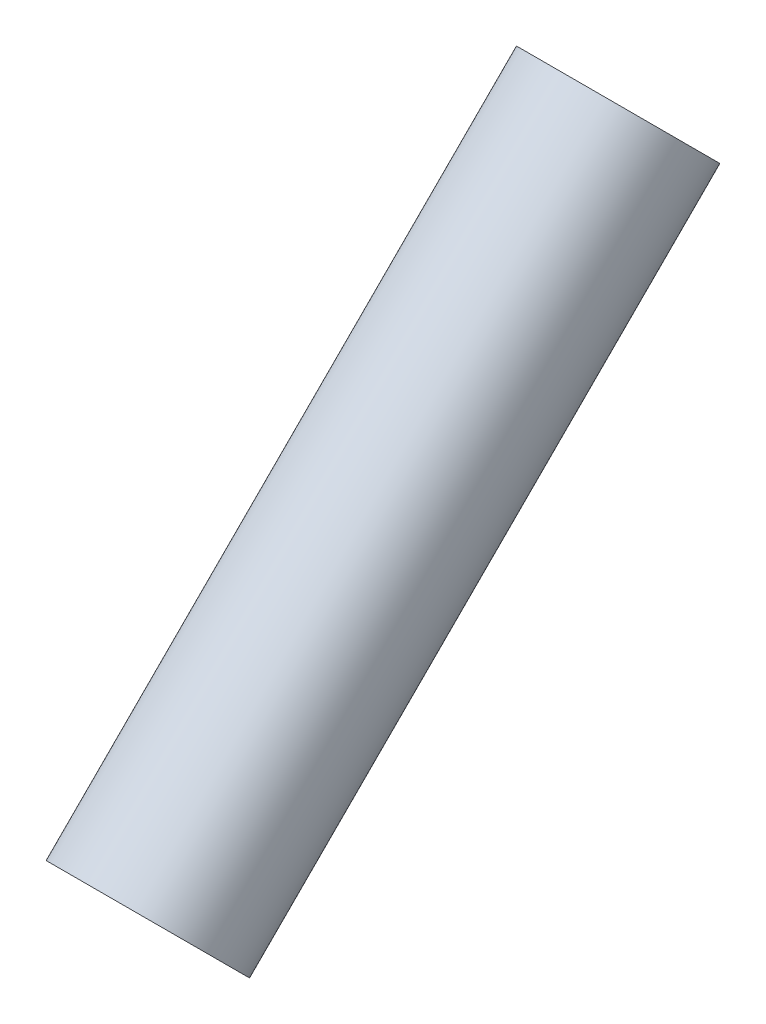
ISO-10303-21;
HEADER;
FILE_DESCRIPTION(('STEP AP214'),'2;1');
FILE_NAME('part.step','',(''),(''),'','','');
FILE_SCHEMA(('AUTOMOTIVE_DESIGN { 1 0 10303 214 1 1 1 1 }'));
ENDSEC;
DATA;
#1=APPLICATION_CONTEXT('core data for automotive mechanical design processes');
#2=APPLICATION_PROTOCOL_DEFINITION('international standard','automotive_design',2000,#1);
#3=PRODUCT_CONTEXT('',#1,'mechanical');
#4=PRODUCT('Part','Part','',(#3));
#5=PRODUCT_RELATED_PRODUCT_CATEGORY('part','',(#4));
#6=PRODUCT_DEFINITION_FORMATION('','',#4);
#7=PRODUCT_DEFINITION_CONTEXT('part definition',#1,'design');
#8=PRODUCT_DEFINITION('design','',#6,#7);
#9=PRODUCT_DEFINITION_SHAPE('','',#8);
#10=(LENGTH_UNIT() NAMED_UNIT(*) SI_UNIT(.MILLI.,.METRE.));
#11=(NAMED_UNIT(*) PLANE_ANGLE_UNIT() SI_UNIT($,.RADIAN.));
#12=(NAMED_UNIT(*) SI_UNIT($,.STERADIAN.) SOLID_ANGLE_UNIT());
#13=UNCERTAINTY_MEASURE_WITH_UNIT(LENGTH_MEASURE(1.E-05),#10,'distance_accuracy_value','');
#14=(GEOMETRIC_REPRESENTATION_CONTEXT(3) GLOBAL_UNCERTAINTY_ASSIGNED_CONTEXT((#13)) GLOBAL_UNIT_ASSIGNED_CONTEXT((#10,
#11,#12)) REPRESENTATION_CONTEXT('',''));
#15=CARTESIAN_POINT('',(0.,0.,0.));
#16=DIRECTION('',(0.,0.,1.));
#17=DIRECTION('',(1.,0.,0.));
#18=AXIS2_PLACEMENT_3D('',#15,#16,#17);
#19=CARTESIAN_POINT('',(0.,-110.131881169806,110.131881169806));
#20=DIRECTION('',(0.,-0.707106781186544,0.707106781186552));
#21=DIRECTION('',(0.,-0.707106781186552,-0.707106781186544));
#22=AXIS2_PLACEMENT_3D('',#19,#20,#21);
#23=PLANE('',#22);
#24=CARTESIAN_POINT('',(0.,66.644814126832,286.908576466443));
#25=DIRECTION('',(0.,0.707106781186544,-0.707106781186552));
#26=DIRECTION('',(0.,0.707106781186552,0.707106781186544));
#27=AXIS2_PLACEMENT_3D('',#24,#25,#26);
#28=CIRCLE('',#27,12.9999999999992);
#29=CARTESIAN_POINT('',(0.,75.8372022822566,296.100964621867));
#30=VERTEX_POINT('',#29);
#31=EDGE_CURVE('E10',#30,#30,#28,.T.);
#32=ORIENTED_EDGE('',*,*,#31,.T.);
#33=EDGE_LOOP('',(#32));
#34=FACE_BOUND('',#33,.T.);
#35=CARTESIAN_POINT('',(0.,66.6448141268321,286.908576466443));
#36=DIRECTION('',(0.,0.707106781186544,-0.707106781186552));
#37=DIRECTION('',(0.,0.707106781186552,0.707106781186544));
#38=AXIS2_PLACEMENT_3D('',#35,#36,#37);
#39=CIRCLE('',#38,14.9999999999991);
#40=CARTESIAN_POINT('',(0.,77.2514158446297,297.51517818424));
#41=VERTEX_POINT('',#40);
#42=EDGE_CURVE('E49',#41,#41,#39,.T.);
#43=ORIENTED_EDGE('',*,*,#42,.F.);
#44=EDGE_LOOP('',(#43));
#45=FACE_BOUND('',#44,.T.);
#46=ADVANCED_FACE('F35',(#34,#45),#23,.T.);
#47=CARTESIAN_POINT('',(0.,176.776695296637,176.776695296637));
#48=DIRECTION('',(0.,0.707106781186544,-0.707106781186552));
#49=DIRECTION('',(0.,0.707106781186552,0.707106781186544));
#50=AXIS2_PLACEMENT_3D('',#47,#48,#49);
#51=CYLINDRICAL_SURFACE('',#50,12.9999999999995);
#52=CARTESIAN_POINT('',(0.,151.553607439304,201.99978315397));
#53=DIRECTION('',(0.,0.707106781186544,-0.707106781186552));
#54=DIRECTION('',(0.,0.707106781186552,0.707106781186544));
#55=AXIS2_PLACEMENT_3D('',#52,#53,#54);
#56=CIRCLE('',#55,12.9999999999999);
#57=CARTESIAN_POINT('',(0.,160.745995594729,211.192171309395));
#58=VERTEX_POINT('',#57);
#59=EDGE_CURVE('E41',#58,#58,#56,.T.);
#60=ORIENTED_EDGE('',*,*,#59,.T.);
#61=EDGE_LOOP('',(#60));
#62=FACE_BOUND('',#61,.T.);
#63=ORIENTED_EDGE('',*,*,#31,.F.);
#64=EDGE_LOOP('',(#63));
#65=FACE_BOUND('',#64,.T.);
#66=ADVANCED_FACE('F59',(#62,#65),#51,.F.);
#67=CARTESIAN_POINT('',(0.,-25.2230878573346,25.2230878573341));
#68=DIRECTION('',(0.,0.707106781186544,-0.707106781186552));
#69=DIRECTION('',(0.,0.707106781186552,0.707106781186544));
#70=AXIS2_PLACEMENT_3D('',#67,#68,#69);
#71=PLANE('',#70);
#72=CARTESIAN_POINT('',(0.,151.553607439304,201.99978315397));
#73=DIRECTION('',(0.,0.707106781186544,-0.707106781186552));
#74=DIRECTION('',(0.,0.707106781186552,0.707106781186544));
#75=AXIS2_PLACEMENT_3D('',#72,#73,#74);
#76=CIRCLE('',#75,14.9999999999998);
#77=CARTESIAN_POINT('',(0.,162.160209157102,212.606384871768));
#78=VERTEX_POINT('',#77);
#79=EDGE_CURVE('E45',#78,#78,#76,.T.);
#80=ORIENTED_EDGE('',*,*,#79,.T.);
#81=EDGE_LOOP('',(#80));
#82=FACE_BOUND('',#81,.T.);
#83=ORIENTED_EDGE('',*,*,#59,.F.);
#84=EDGE_LOOP('',(#83));
#85=FACE_BOUND('',#84,.T.);
#86=ADVANCED_FACE('F63',(#82,#85),#71,.T.);
#87=CARTESIAN_POINT('',(0.,176.776695296637,176.776695296637));
#88=DIRECTION('',(0.,0.707106781186544,-0.707106781186552));
#89=DIRECTION('',(0.,0.707106781186552,0.707106781186544));
#90=AXIS2_PLACEMENT_3D('',#87,#88,#89);
#91=CYLINDRICAL_SURFACE('',#90,14.9999999999995);
#92=ORIENTED_EDGE('',*,*,#42,.T.);
#93=EDGE_LOOP('',(#92));
#94=FACE_BOUND('',#93,.T.);
#95=ORIENTED_EDGE('',*,*,#79,.F.);
#96=EDGE_LOOP('',(#95));
#97=FACE_BOUND('',#96,.T.);
#98=ADVANCED_FACE('F55',(#94,#97),#91,.T.);
#99=CLOSED_SHELL('',(#46,#66,#86,#98));
#100=MANIFOLD_SOLID_BREP('B2',#99);
#101=ADVANCED_BREP_SHAPE_REPRESENTATION('',(#18,#100),#14);
#102=SHAPE_DEFINITION_REPRESENTATION(#9,#101);
ENDSEC;
END-ISO-10303-21;
